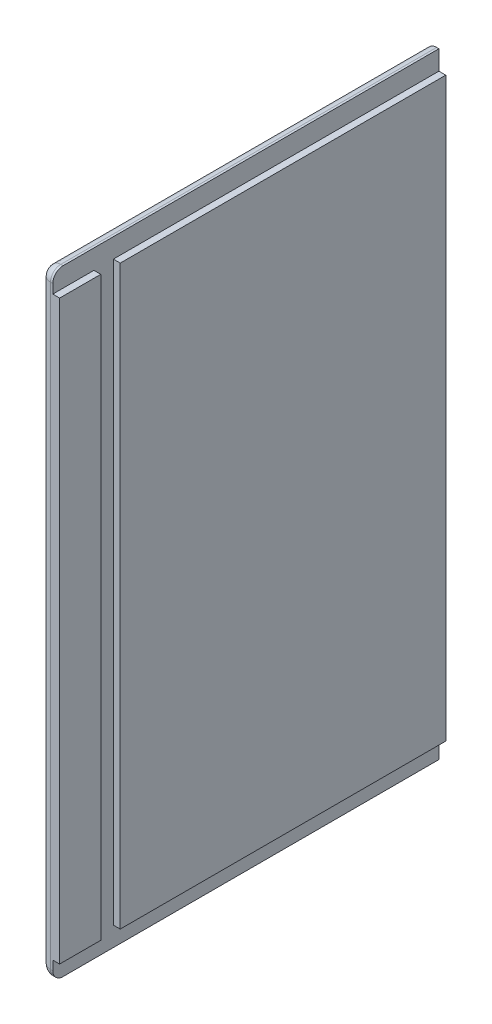
ISO-10303-21;
HEADER;
FILE_DESCRIPTION(('STEP AP214'),'2;1');
FILE_NAME('part.step','',(''),(''),'','','');
FILE_SCHEMA(('AUTOMOTIVE_DESIGN { 1 0 10303 214 1 1 1 1 }'));
ENDSEC;
DATA;
#1=APPLICATION_CONTEXT('core data for automotive mechanical design processes');
#2=APPLICATION_PROTOCOL_DEFINITION('international standard','automotive_design',2000,#1);
#3=PRODUCT_CONTEXT('',#1,'mechanical');
#4=PRODUCT('Part','Part','',(#3));
#5=PRODUCT_RELATED_PRODUCT_CATEGORY('part','',(#4));
#6=PRODUCT_DEFINITION_FORMATION('','',#4);
#7=PRODUCT_DEFINITION_CONTEXT('part definition',#1,'design');
#8=PRODUCT_DEFINITION('design','',#6,#7);
#9=PRODUCT_DEFINITION_SHAPE('','',#8);
#10=(LENGTH_UNIT() NAMED_UNIT(*) SI_UNIT(.MILLI.,.METRE.));
#11=(NAMED_UNIT(*) PLANE_ANGLE_UNIT() SI_UNIT($,.RADIAN.));
#12=(NAMED_UNIT(*) SI_UNIT($,.STERADIAN.) SOLID_ANGLE_UNIT());
#13=UNCERTAINTY_MEASURE_WITH_UNIT(LENGTH_MEASURE(1.E-05),#10,'distance_accuracy_value','');
#14=(GEOMETRIC_REPRESENTATION_CONTEXT(3) GLOBAL_UNCERTAINTY_ASSIGNED_CONTEXT((#13)) GLOBAL_UNIT_ASSIGNED_CONTEXT((#10,
#11,#12)) REPRESENTATION_CONTEXT('',''));
#15=CARTESIAN_POINT('',(0.,0.,0.));
#16=DIRECTION('',(0.,0.,1.));
#17=DIRECTION('',(1.,0.,0.));
#18=AXIS2_PLACEMENT_3D('',#15,#16,#17);
#19=CARTESIAN_POINT('',(18.,570.,0.));
#20=DIRECTION('',(0.,-1.,0.));
#21=DIRECTION('',(0.,0.,-1.));
#22=AXIS2_PLACEMENT_3D('',#19,#20,#21);
#23=PLANE('',#22);
#24=DIRECTION('',(0.,0.,1.));
#25=VECTOR('',#24,1.);
#26=CARTESIAN_POINT('',(9.525,570.,0.));
#27=LINE('',#26,#25);
#28=CARTESIAN_POINT('',(9.525,570.,-357.50000001));
#29=VERTEX_POINT('',#28);
#30=CARTESIAN_POINT('',(9.525,570.,-9.525));
#31=VERTEX_POINT('',#30);
#32=EDGE_CURVE('E243',#29,#31,#27,.T.);
#33=ORIENTED_EDGE('',*,*,#32,.T.);
#34=DIRECTION('',(-1.,0.,0.));
#35=VECTOR('',#34,1.);
#36=CARTESIAN_POINT('',(18.,570.,-9.525));
#37=LINE('',#36,#35);
#38=CARTESIAN_POINT('',(11.65,570.,-9.525));
#39=VERTEX_POINT('',#38);
#40=EDGE_CURVE('E245',#31,#39,#37,.F.);
#41=ORIENTED_EDGE('',*,*,#40,.T.);
#42=DIRECTION('',(0.,0.,1.));
#43=VECTOR('',#42,1.);
#44=CARTESIAN_POINT('',(11.65,570.,0.));
#45=LINE('',#44,#43);
#46=CARTESIAN_POINT('',(11.65,570.,-357.50000001));
#47=VERTEX_POINT('',#46);
#48=EDGE_CURVE('E172',#47,#39,#45,.T.);
#49=ORIENTED_EDGE('',*,*,#48,.F.);
#50=DIRECTION('',(-1.,0.,0.));
#51=VECTOR('',#50,1.);
#52=CARTESIAN_POINT('',(18.,570.,-357.50000001));
#53=LINE('',#52,#51);
#54=EDGE_CURVE('E221',#47,#29,#53,.T.);
#55=ORIENTED_EDGE('',*,*,#54,.T.);
#56=EDGE_LOOP('',(#33,#41,#49,#55));
#57=FACE_BOUND('',#56,.T.);
#58=ADVANCED_FACE('F33',(#57),#23,.F.);
#59=CARTESIAN_POINT('',(18.,0.,0.));
#60=DIRECTION('',(-1.,0.,0.));
#61=DIRECTION('',(0.,0.,1.));
#62=AXIS2_PLACEMENT_3D('',#59,#60,#61);
#63=PLANE('',#62);
#64=DIRECTION('',(0.,1.,0.));
#65=VECTOR('',#64,1.);
#66=CARTESIAN_POINT('',(18.,0.,-357.50000001));
#67=LINE('',#66,#65);
#68=CARTESIAN_POINT('',(18.,18.,-357.50000001));
#69=VERTEX_POINT('',#68);
#70=CARTESIAN_POINT('',(18.,552.,-357.50000001));
#71=VERTEX_POINT('',#70);
#72=EDGE_CURVE('E218',#69,#71,#67,.T.);
#73=ORIENTED_EDGE('',*,*,#72,.T.);
#74=DIRECTION('',(0.,0.,-1.));
#75=VECTOR('',#74,1.);
#76=CARTESIAN_POINT('',(18.,552.,0.));
#77=LINE('',#76,#75);
#78=CARTESIAN_POINT('',(18.,552.,-56.1));
#79=VERTEX_POINT('',#78);
#80=EDGE_CURVE('E270',#79,#71,#77,.T.);
#81=ORIENTED_EDGE('',*,*,#80,.F.);
#82=DIRECTION('',(0.,1.,0.));
#83=VECTOR('',#82,1.);
#84=CARTESIAN_POINT('',(18.,563.65,-56.1));
#85=LINE('',#84,#83);
#86=CARTESIAN_POINT('',(18.,18.,-56.1000000000001));
#87=VERTEX_POINT('',#86);
#88=EDGE_CURVE('E206',#87,#79,#85,.T.);
#89=ORIENTED_EDGE('',*,*,#88,.F.);
#90=DIRECTION('',(0.,0.,1.));
#91=VECTOR('',#90,1.);
#92=CARTESIAN_POINT('',(18.,18.,0.));
#93=LINE('',#92,#91);
#94=EDGE_CURVE('E187',#69,#87,#93,.T.);
#95=ORIENTED_EDGE('',*,*,#94,.F.);
#96=EDGE_LOOP('',(#73,#81,#89,#95));
#97=FACE_BOUND('',#96,.T.);
#98=ADVANCED_FACE('F319',(#97),#63,.F.);
#99=CARTESIAN_POINT('',(18.,0.,0.));
#100=DIRECTION('',(0.,0.,-1.));
#101=DIRECTION('',(-1.,0.,0.));
#102=AXIS2_PLACEMENT_3D('',#99,#100,#101);
#103=PLANE('',#102);
#104=DIRECTION('',(0.,-1.,0.));
#105=VECTOR('',#104,1.);
#106=CARTESIAN_POINT('',(9.525,0.,0.));
#107=LINE('',#106,#105);
#108=CARTESIAN_POINT('',(9.525,560.475,0.));
#109=VERTEX_POINT('',#108);
#110=CARTESIAN_POINT('',(9.525,9.525,0.));
#111=VERTEX_POINT('',#110);
#112=EDGE_CURVE('E234',#109,#111,#107,.T.);
#113=ORIENTED_EDGE('',*,*,#112,.T.);
#114=DIRECTION('',(-1.,0.,0.));
#115=VECTOR('',#114,1.);
#116=CARTESIAN_POINT('',(18.,9.525,0.));
#117=LINE('',#116,#115);
#118=CARTESIAN_POINT('',(11.65,9.525,0.));
#119=VERTEX_POINT('',#118);
#120=EDGE_CURVE('E238',#111,#119,#117,.F.);
#121=ORIENTED_EDGE('',*,*,#120,.T.);
#122=DIRECTION('',(0.,-1.,0.));
#123=VECTOR('',#122,1.);
#124=CARTESIAN_POINT('',(11.65,0.,0.));
#125=LINE('',#124,#123);
#126=CARTESIAN_POINT('',(11.65,18.,0.));
#127=VERTEX_POINT('',#126);
#128=EDGE_CURVE('E184',#127,#119,#125,.T.);
#129=ORIENTED_EDGE('',*,*,#128,.F.);
#130=DIRECTION('',(1.,0.,0.));
#131=VECTOR('',#130,1.);
#132=CARTESIAN_POINT('',(11.65,18.,0.));
#133=LINE('',#132,#131);
#134=CARTESIAN_POINT('',(18.,18.,0.));
#135=VERTEX_POINT('',#134);
#136=EDGE_CURVE('E197',#127,#135,#133,.T.);
#137=ORIENTED_EDGE('',*,*,#136,.T.);
#138=DIRECTION('',(0.,-1.,0.));
#139=VECTOR('',#138,1.);
#140=CARTESIAN_POINT('',(18.,0.,0.));
#141=LINE('',#140,#139);
#142=CARTESIAN_POINT('',(18.,552.,0.));
#143=VERTEX_POINT('',#142);
#144=EDGE_CURVE('E170',#143,#135,#141,.T.);
#145=ORIENTED_EDGE('',*,*,#144,.F.);
#146=DIRECTION('',(1.,0.,0.));
#147=VECTOR('',#146,1.);
#148=CARTESIAN_POINT('',(11.65,552.,0.));
#149=LINE('',#148,#147);
#150=CARTESIAN_POINT('',(11.65,552.,0.));
#151=VERTEX_POINT('',#150);
#152=EDGE_CURVE('E161',#151,#143,#149,.T.);
#153=ORIENTED_EDGE('',*,*,#152,.F.);
#154=DIRECTION('',(0.,-1.,0.));
#155=VECTOR('',#154,1.);
#156=CARTESIAN_POINT('',(11.65,570.,0.));
#157=LINE('',#156,#155);
#158=CARTESIAN_POINT('',(11.65,560.475,0.));
#159=VERTEX_POINT('',#158);
#160=EDGE_CURVE('E144',#159,#151,#157,.T.);
#161=ORIENTED_EDGE('',*,*,#160,.F.);
#162=DIRECTION('',(-1.,0.,0.));
#163=VECTOR('',#162,1.);
#164=CARTESIAN_POINT('',(18.,560.475,0.));
#165=LINE('',#164,#163);
#166=EDGE_CURVE('E236',#159,#109,#165,.T.);
#167=ORIENTED_EDGE('',*,*,#166,.T.);
#168=EDGE_LOOP('',(#113,#121,#129,#137,#145,#153,#161,#167));
#169=FACE_BOUND('',#168,.T.);
#170=ADVANCED_FACE('F168',(#169),#103,.F.);
#171=CARTESIAN_POINT('',(18.,0.,0.));
#172=DIRECTION('',(0.,1.,0.));
#173=DIRECTION('',(0.,0.,1.));
#174=AXIS2_PLACEMENT_3D('',#171,#172,#173);
#175=PLANE('',#174);
#176=DIRECTION('',(0.,0.,-1.));
#177=VECTOR('',#176,1.);
#178=CARTESIAN_POINT('',(11.65,0.,0.));
#179=LINE('',#178,#177);
#180=CARTESIAN_POINT('',(11.65,0.,-9.525));
#181=VERTEX_POINT('',#180);
#182=CARTESIAN_POINT('',(11.65,0.,-357.50000001));
#183=VERTEX_POINT('',#182);
#184=EDGE_CURVE('E186',#181,#183,#179,.T.);
#185=ORIENTED_EDGE('',*,*,#184,.F.);
#186=DIRECTION('',(-1.,0.,0.));
#187=VECTOR('',#186,1.);
#188=CARTESIAN_POINT('',(18.,0.,-9.525));
#189=LINE('',#188,#187);
#190=CARTESIAN_POINT('',(9.525,0.,-9.525));
#191=VERTEX_POINT('',#190);
#192=EDGE_CURVE('E231',#181,#191,#189,.T.);
#193=ORIENTED_EDGE('',*,*,#192,.T.);
#194=DIRECTION('',(0.,0.,-1.));
#195=VECTOR('',#194,1.);
#196=CARTESIAN_POINT('',(9.525,0.,-357.50000001));
#197=LINE('',#196,#195);
#198=CARTESIAN_POINT('',(9.525,0.,-357.50000001));
#199=VERTEX_POINT('',#198);
#200=EDGE_CURVE('E229',#191,#199,#197,.T.);
#201=ORIENTED_EDGE('',*,*,#200,.T.);
#202=DIRECTION('',(-1.,0.,0.));
#203=VECTOR('',#202,1.);
#204=CARTESIAN_POINT('',(18.,0.,-357.50000001));
#205=LINE('',#204,#203);
#206=EDGE_CURVE('E226',#183,#199,#205,.T.);
#207=ORIENTED_EDGE('',*,*,#206,.F.);
#208=EDGE_LOOP('',(#185,#193,#201,#207));
#209=FACE_BOUND('',#208,.T.);
#210=ADVANCED_FACE('F309',(#209),#175,.F.);
#211=CARTESIAN_POINT('',(18.,0.,-357.50000001));
#212=DIRECTION('',(0.,0.,1.));
#213=DIRECTION('',(1.,0.,0.));
#214=AXIS2_PLACEMENT_3D('',#211,#212,#213);
#215=PLANE('',#214);
#216=ORIENTED_EDGE('',*,*,#206,.T.);
#217=CARTESIAN_POINT('',(9.525,9.525,-357.50000001));
#218=DIRECTION('',(0.,0.,1.));
#219=DIRECTION('',(1.,0.,0.));
#220=AXIS2_PLACEMENT_3D('',#217,#218,#219);
#221=CIRCLE('',#220,9.525);
#222=CARTESIAN_POINT('',(0.,9.525,-357.50000001));
#223=VERTEX_POINT('',#222);
#224=EDGE_CURVE('E249',#199,#223,#221,.F.);
#225=ORIENTED_EDGE('',*,*,#224,.T.);
#226=DIRECTION('',(0.,1.,0.));
#227=VECTOR('',#226,1.);
#228=CARTESIAN_POINT('',(0.,0.,-357.50000001));
#229=LINE('',#228,#227);
#230=CARTESIAN_POINT('',(0.,560.475,-357.50000001));
#231=VERTEX_POINT('',#230);
#232=EDGE_CURVE('E213',#223,#231,#229,.T.);
#233=ORIENTED_EDGE('',*,*,#232,.T.);
#234=CARTESIAN_POINT('',(9.525,560.475,-357.50000001));
#235=DIRECTION('',(0.,0.,1.));
#236=DIRECTION('',(1.,0.,0.));
#237=AXIS2_PLACEMENT_3D('',#234,#235,#236);
#238=CIRCLE('',#237,9.525);
#239=EDGE_CURVE('E247',#231,#29,#238,.F.);
#240=ORIENTED_EDGE('',*,*,#239,.T.);
#241=ORIENTED_EDGE('',*,*,#54,.F.);
#242=DIRECTION('',(0.,1.,0.));
#243=VECTOR('',#242,1.);
#244=CARTESIAN_POINT('',(11.65,570.,-357.50000001));
#245=LINE('',#244,#243);
#246=CARTESIAN_POINT('',(11.65,552.,-357.50000001));
#247=VERTEX_POINT('',#246);
#248=EDGE_CURVE('E165',#247,#47,#245,.T.);
#249=ORIENTED_EDGE('',*,*,#248,.F.);
#250=DIRECTION('',(1.,0.,0.));
#251=VECTOR('',#250,1.);
#252=CARTESIAN_POINT('',(11.65,552.,-357.50000001));
#253=LINE('',#252,#251);
#254=EDGE_CURVE('E171',#247,#71,#253,.T.);
#255=ORIENTED_EDGE('',*,*,#254,.T.);
#256=ORIENTED_EDGE('',*,*,#72,.F.);
#257=DIRECTION('',(1.,0.,0.));
#258=VECTOR('',#257,1.);
#259=CARTESIAN_POINT('',(11.65,18.,-357.50000001));
#260=LINE('',#259,#258);
#261=CARTESIAN_POINT('',(11.65,18.,-357.50000001));
#262=VERTEX_POINT('',#261);
#263=EDGE_CURVE('E195',#262,#69,#260,.T.);
#264=ORIENTED_EDGE('',*,*,#263,.F.);
#265=DIRECTION('',(0.,1.,0.));
#266=VECTOR('',#265,1.);
#267=CARTESIAN_POINT('',(11.65,0.,-357.50000001));
#268=LINE('',#267,#266);
#269=EDGE_CURVE('E189',#183,#262,#268,.T.);
#270=ORIENTED_EDGE('',*,*,#269,.F.);
#271=EDGE_LOOP('',(#216,#225,#233,#240,#241,#249,#255,#256,#264,#270));
#272=FACE_BOUND('',#271,.T.);
#273=ADVANCED_FACE('F283',(#272),#215,.F.);
#274=DIRECTION('',(0.,-1.,0.));
#275=VECTOR('',#274,1.);
#276=CARTESIAN_POINT('',(18.,563.65,-38.1));
#277=LINE('',#276,#275);
#278=CARTESIAN_POINT('',(18.,552.,-38.1));
#279=VERTEX_POINT('',#278);
#280=CARTESIAN_POINT('',(18.,18.,-38.1000000000001));
#281=VERTEX_POINT('',#280);
#282=EDGE_CURVE('E211',#279,#281,#277,.T.);
#283=ORIENTED_EDGE('',*,*,#282,.F.);
#284=EDGE_CURVE('E157',#143,#279,#77,.T.);
#285=ORIENTED_EDGE('',*,*,#284,.F.);
#286=ORIENTED_EDGE('',*,*,#144,.T.);
#287=EDGE_CURVE('E183',#281,#135,#93,.T.);
#288=ORIENTED_EDGE('',*,*,#287,.F.);
#289=EDGE_LOOP('',(#283,#285,#286,#288));
#290=FACE_BOUND('',#289,.T.);
#291=ADVANCED_FACE('F341',(#290),#63,.F.);
#292=CARTESIAN_POINT('',(0.,0.,0.));
#293=DIRECTION('',(-1.,0.,0.));
#294=DIRECTION('',(0.,0.,1.));
#295=AXIS2_PLACEMENT_3D('',#292,#293,#294);
#296=PLANE('',#295);
#297=ORIENTED_EDGE('',*,*,#232,.F.);
#298=DIRECTION('',(0.,0.,-1.));
#299=VECTOR('',#298,1.);
#300=CARTESIAN_POINT('',(0.,9.525,0.));
#301=LINE('',#300,#299);
#302=CARTESIAN_POINT('',(0.,9.525,-9.525));
#303=VERTEX_POINT('',#302);
#304=EDGE_CURVE('E11',#223,#303,#301,.F.);
#305=ORIENTED_EDGE('',*,*,#304,.T.);
#306=DIRECTION('',(0.,-1.,0.));
#307=VECTOR('',#306,1.);
#308=CARTESIAN_POINT('',(0.,570.,-9.525));
#309=LINE('',#308,#307);
#310=CARTESIAN_POINT('',(0.,560.475,-9.525));
#311=VERTEX_POINT('',#310);
#312=EDGE_CURVE('E42',#303,#311,#309,.F.);
#313=ORIENTED_EDGE('',*,*,#312,.T.);
#314=DIRECTION('',(0.,0.,1.));
#315=VECTOR('',#314,1.);
#316=CARTESIAN_POINT('',(0.,560.475,-357.50000001));
#317=LINE('',#316,#315);
#318=EDGE_CURVE('E251',#311,#231,#317,.F.);
#319=ORIENTED_EDGE('',*,*,#318,.T.);
#320=EDGE_LOOP('',(#297,#305,#313,#319));
#321=FACE_BOUND('',#320,.T.);
#322=ADVANCED_FACE('F344',(#321),#296,.T.);
#323=CARTESIAN_POINT('',(11.65,563.65,-56.1));
#324=DIRECTION('',(0.,0.,-1.));
#325=DIRECTION('',(0.,1.,0.));
#326=AXIS2_PLACEMENT_3D('',#323,#324,#325);
#327=PLANE('',#326);
#328=ORIENTED_EDGE('',*,*,#88,.T.);
#329=DIRECTION('',(-1.,0.,0.));
#330=VECTOR('',#329,1.);
#331=CARTESIAN_POINT('',(11.65,552.,-56.1));
#332=LINE('',#331,#330);
#333=CARTESIAN_POINT('',(11.65,552.,-56.1));
#334=VERTEX_POINT('',#333);
#335=EDGE_CURVE('E180',#79,#334,#332,.T.);
#336=ORIENTED_EDGE('',*,*,#335,.T.);
#337=DIRECTION('',(0.,1.,0.));
#338=VECTOR('',#337,1.);
#339=CARTESIAN_POINT('',(11.65,563.65,-56.1));
#340=LINE('',#339,#338);
#341=CARTESIAN_POINT('',(11.65,18.,-56.1000000000001));
#342=VERTEX_POINT('',#341);
#343=EDGE_CURVE('E207',#342,#334,#340,.T.);
#344=ORIENTED_EDGE('',*,*,#343,.F.);
#345=DIRECTION('',(1.,0.,0.));
#346=VECTOR('',#345,1.);
#347=CARTESIAN_POINT('',(11.65,18.,-56.1000000000001));
#348=LINE('',#347,#346);
#349=EDGE_CURVE('E203',#342,#87,#348,.T.);
#350=ORIENTED_EDGE('',*,*,#349,.T.);
#351=EDGE_LOOP('',(#328,#336,#344,#350));
#352=FACE_BOUND('',#351,.T.);
#353=ADVANCED_FACE('F321',(#352),#327,.F.);
#354=CARTESIAN_POINT('',(11.65,563.65,-38.1));
#355=DIRECTION('',(0.,0.,1.));
#356=DIRECTION('',(0.,-1.,0.));
#357=AXIS2_PLACEMENT_3D('',#354,#355,#356);
#358=PLANE('',#357);
#359=DIRECTION('',(0.,-1.,0.));
#360=VECTOR('',#359,1.);
#361=CARTESIAN_POINT('',(11.65,563.65,-38.1));
#362=LINE('',#361,#360);
#363=CARTESIAN_POINT('',(11.65,552.,-38.1));
#364=VERTEX_POINT('',#363);
#365=CARTESIAN_POINT('',(11.65,18.,-38.1));
#366=VERTEX_POINT('',#365);
#367=EDGE_CURVE('E210',#364,#366,#362,.T.);
#368=ORIENTED_EDGE('',*,*,#367,.F.);
#369=DIRECTION('',(1.,0.,0.));
#370=VECTOR('',#369,1.);
#371=CARTESIAN_POINT('',(11.65,552.,-38.1));
#372=LINE('',#371,#370);
#373=EDGE_CURVE('E164',#364,#279,#372,.T.);
#374=ORIENTED_EDGE('',*,*,#373,.T.);
#375=ORIENTED_EDGE('',*,*,#282,.T.);
#376=DIRECTION('',(-1.,0.,0.));
#377=VECTOR('',#376,1.);
#378=CARTESIAN_POINT('',(11.65,18.,-38.1000000000001));
#379=LINE('',#378,#377);
#380=EDGE_CURVE('E199',#281,#366,#379,.T.);
#381=ORIENTED_EDGE('',*,*,#380,.T.);
#382=EDGE_LOOP('',(#368,#374,#375,#381));
#383=FACE_BOUND('',#382,.T.);
#384=ADVANCED_FACE('F394',(#383),#358,.F.);
#385=CARTESIAN_POINT('',(11.65,0.,0.));
#386=DIRECTION('',(-1.,0.,0.));
#387=DIRECTION('',(0.,0.,1.));
#388=AXIS2_PLACEMENT_3D('',#385,#386,#387);
#389=PLANE('',#388);
#390=ORIENTED_EDGE('',*,*,#128,.T.);
#391=CARTESIAN_POINT('',(11.65,9.525,-9.525));
#392=DIRECTION('',(-1.,0.,0.));
#393=DIRECTION('',(0.,0.,1.));
#394=AXIS2_PLACEMENT_3D('',#391,#392,#393);
#395=CIRCLE('',#394,9.525);
#396=EDGE_CURVE('E241',#119,#181,#395,.F.);
#397=ORIENTED_EDGE('',*,*,#396,.T.);
#398=ORIENTED_EDGE('',*,*,#184,.T.);
#399=ORIENTED_EDGE('',*,*,#269,.T.);
#400=DIRECTION('',(0.,0.,1.));
#401=VECTOR('',#400,1.);
#402=CARTESIAN_POINT('',(11.65,18.,0.));
#403=LINE('',#402,#401);
#404=EDGE_CURVE('E192',#262,#342,#403,.T.);
#405=ORIENTED_EDGE('',*,*,#404,.T.);
#406=ORIENTED_EDGE('',*,*,#343,.T.);
#407=DIRECTION('',(0.,0.,-1.));
#408=VECTOR('',#407,1.);
#409=CARTESIAN_POINT('',(11.65,552.,0.));
#410=LINE('',#409,#408);
#411=EDGE_CURVE('E156',#334,#247,#410,.T.);
#412=ORIENTED_EDGE('',*,*,#411,.T.);
#413=ORIENTED_EDGE('',*,*,#248,.T.);
#414=ORIENTED_EDGE('',*,*,#48,.T.);
#415=CARTESIAN_POINT('',(11.65,560.475,-9.525));
#416=DIRECTION('',(-1.,0.,0.));
#417=DIRECTION('',(0.,0.,1.));
#418=AXIS2_PLACEMENT_3D('',#415,#416,#417);
#419=CIRCLE('',#418,9.525);
#420=EDGE_CURVE('E152',#39,#159,#419,.F.);
#421=ORIENTED_EDGE('',*,*,#420,.T.);
#422=ORIENTED_EDGE('',*,*,#160,.T.);
#423=EDGE_CURVE('E148',#151,#364,#410,.T.);
#424=ORIENTED_EDGE('',*,*,#423,.T.);
#425=ORIENTED_EDGE('',*,*,#367,.T.);
#426=EDGE_CURVE('E191',#366,#127,#403,.T.);
#427=ORIENTED_EDGE('',*,*,#426,.T.);
#428=EDGE_LOOP('',(#390,#397,#398,#399,#405,#406,#412,#413,#414,#421,#422,#424,#425,#427));
#429=FACE_BOUND('',#428,.T.);
#430=ADVANCED_FACE('F147',(#429),#389,.F.);
#431=CARTESIAN_POINT('',(11.65,18.,0.));
#432=DIRECTION('',(0.,1.,0.));
#433=DIRECTION('',(0.,0.,1.));
#434=AXIS2_PLACEMENT_3D('',#431,#432,#433);
#435=PLANE('',#434);
#436=ORIENTED_EDGE('',*,*,#404,.F.);
#437=ORIENTED_EDGE('',*,*,#263,.T.);
#438=ORIENTED_EDGE('',*,*,#94,.T.);
#439=ORIENTED_EDGE('',*,*,#349,.F.);
#440=EDGE_LOOP('',(#436,#437,#438,#439));
#441=FACE_BOUND('',#440,.T.);
#442=ADVANCED_FACE('F316',(#441),#435,.F.);
#443=ORIENTED_EDGE('',*,*,#287,.T.);
#444=ORIENTED_EDGE('',*,*,#136,.F.);
#445=ORIENTED_EDGE('',*,*,#426,.F.);
#446=ORIENTED_EDGE('',*,*,#380,.F.);
#447=EDGE_LOOP('',(#443,#444,#445,#446));
#448=FACE_BOUND('',#447,.T.);
#449=ADVANCED_FACE('F325',(#448),#435,.F.);
#450=CARTESIAN_POINT('',(11.65,552.,0.));
#451=DIRECTION('',(0.,-1.,0.));
#452=DIRECTION('',(0.,0.,-1.));
#453=AXIS2_PLACEMENT_3D('',#450,#451,#452);
#454=PLANE('',#453);
#455=ORIENTED_EDGE('',*,*,#80,.T.);
#456=ORIENTED_EDGE('',*,*,#254,.F.);
#457=ORIENTED_EDGE('',*,*,#411,.F.);
#458=ORIENTED_EDGE('',*,*,#335,.F.);
#459=EDGE_LOOP('',(#455,#456,#457,#458));
#460=FACE_BOUND('',#459,.T.);
#461=ADVANCED_FACE('F323',(#460),#454,.F.);
#462=ORIENTED_EDGE('',*,*,#423,.F.);
#463=ORIENTED_EDGE('',*,*,#152,.T.);
#464=ORIENTED_EDGE('',*,*,#284,.T.);
#465=ORIENTED_EDGE('',*,*,#373,.F.);
#466=EDGE_LOOP('',(#462,#463,#464,#465));
#467=FACE_BOUND('',#466,.T.);
#468=ADVANCED_FACE('F160',(#467),#454,.F.);
#469=CARTESIAN_POINT('',(9.525,560.475,0.));
#470=DIRECTION('',(0.,0.,-1.));
#471=DIRECTION('',(-1.,0.,0.));
#472=AXIS2_PLACEMENT_3D('',#469,#470,#471);
#473=CYLINDRICAL_SURFACE('',#472,9.525);
#474=ORIENTED_EDGE('',*,*,#239,.F.);
#475=ORIENTED_EDGE('',*,*,#318,.F.);
#476=CARTESIAN_POINT('',(9.525,560.475,-9.525));
#477=DIRECTION('',(0.,0.,1.));
#478=DIRECTION('',(1.,0.,0.));
#479=AXIS2_PLACEMENT_3D('',#476,#477,#478);
#480=CIRCLE('',#479,9.525);
#481=EDGE_CURVE('E37',#31,#311,#480,.T.);
#482=ORIENTED_EDGE('',*,*,#481,.F.);
#483=ORIENTED_EDGE('',*,*,#32,.F.);
#484=EDGE_LOOP('',(#474,#475,#482,#483));
#485=FACE_BOUND('',#484,.T.);
#486=ADVANCED_FACE('F35',(#485),#473,.T.);
#487=CARTESIAN_POINT('',(18.,560.475,-9.525));
#488=DIRECTION('',(-1.,0.,0.));
#489=DIRECTION('',(0.,0.,1.));
#490=AXIS2_PLACEMENT_3D('',#487,#488,#489);
#491=CYLINDRICAL_SURFACE('',#490,9.525);
#492=ORIENTED_EDGE('',*,*,#420,.F.);
#493=ORIENTED_EDGE('',*,*,#40,.F.);
#494=CARTESIAN_POINT('',(9.525,560.475,-9.525));
#495=DIRECTION('',(-1.,0.,0.));
#496=DIRECTION('',(0.,0.,1.));
#497=AXIS2_PLACEMENT_3D('',#494,#495,#496);
#498=CIRCLE('',#497,9.525);
#499=EDGE_CURVE('E264',#109,#31,#498,.T.);
#500=ORIENTED_EDGE('',*,*,#499,.F.);
#501=ORIENTED_EDGE('',*,*,#166,.F.);
#502=EDGE_LOOP('',(#492,#493,#500,#501));
#503=FACE_BOUND('',#502,.T.);
#504=ADVANCED_FACE('F287',(#503),#491,.T.);
#505=CARTESIAN_POINT('',(9.525,560.475,-9.525));
#506=DIRECTION('',(0.,0.,1.));
#507=DIRECTION('',(1.,0.,0.));
#508=AXIS2_PLACEMENT_3D('',#505,#506,#507);
#509=SPHERICAL_SURFACE('',#508,9.525);
#510=ORIENTED_EDGE('',*,*,#499,.T.);
#511=ORIENTED_EDGE('',*,*,#481,.T.);
#512=CARTESIAN_POINT('',(9.525,560.475,-9.525));
#513=DIRECTION('',(0.,1.,0.));
#514=DIRECTION('',(0.,0.,1.));
#515=AXIS2_PLACEMENT_3D('',#512,#513,#514);
#516=CIRCLE('',#515,9.525);
#517=EDGE_CURVE('E262',#109,#311,#516,.F.);
#518=ORIENTED_EDGE('',*,*,#517,.F.);
#519=EDGE_LOOP('',(#510,#511,#518));
#520=FACE_BOUND('',#519,.T.);
#521=ADVANCED_FACE('F358',(#520),#509,.T.);
#522=CARTESIAN_POINT('',(9.525,9.525,0.));
#523=DIRECTION('',(0.,0.,1.));
#524=DIRECTION('',(1.,0.,0.));
#525=AXIS2_PLACEMENT_3D('',#522,#523,#524);
#526=CYLINDRICAL_SURFACE('',#525,9.525);
#527=ORIENTED_EDGE('',*,*,#224,.F.);
#528=ORIENTED_EDGE('',*,*,#200,.F.);
#529=CARTESIAN_POINT('',(9.525,9.525,-9.525));
#530=DIRECTION('',(0.,0.,1.));
#531=DIRECTION('',(1.,0.,0.));
#532=AXIS2_PLACEMENT_3D('',#529,#530,#531);
#533=CIRCLE('',#532,9.525);
#534=EDGE_CURVE('E259',#303,#191,#533,.T.);
#535=ORIENTED_EDGE('',*,*,#534,.F.);
#536=ORIENTED_EDGE('',*,*,#304,.F.);
#537=EDGE_LOOP('',(#527,#528,#535,#536));
#538=FACE_BOUND('',#537,.T.);
#539=ADVANCED_FACE('F305',(#538),#526,.T.);
#540=CARTESIAN_POINT('',(9.525,0.,-9.525));
#541=DIRECTION('',(0.,1.,0.));
#542=DIRECTION('',(0.,0.,1.));
#543=AXIS2_PLACEMENT_3D('',#540,#541,#542);
#544=CYLINDRICAL_SURFACE('',#543,9.525);
#545=ORIENTED_EDGE('',*,*,#517,.T.);
#546=ORIENTED_EDGE('',*,*,#312,.F.);
#547=CARTESIAN_POINT('',(9.525,9.525,-9.525));
#548=DIRECTION('',(0.,-1.,0.));
#549=DIRECTION('',(0.,0.,-1.));
#550=AXIS2_PLACEMENT_3D('',#547,#548,#549);
#551=CIRCLE('',#550,9.525);
#552=EDGE_CURVE('E256',#111,#303,#551,.T.);
#553=ORIENTED_EDGE('',*,*,#552,.F.);
#554=ORIENTED_EDGE('',*,*,#112,.F.);
#555=EDGE_LOOP('',(#545,#546,#553,#554));
#556=FACE_BOUND('',#555,.T.);
#557=ADVANCED_FACE('F293',(#556),#544,.T.);
#558=CARTESIAN_POINT('',(9.525,9.525,-9.525));
#559=DIRECTION('',(0.,0.,1.));
#560=DIRECTION('',(1.,0.,0.));
#561=AXIS2_PLACEMENT_3D('',#558,#559,#560);
#562=SPHERICAL_SURFACE('',#561,9.525);
#563=ORIENTED_EDGE('',*,*,#552,.T.);
#564=ORIENTED_EDGE('',*,*,#534,.T.);
#565=CARTESIAN_POINT('',(9.525,9.525,-9.525));
#566=DIRECTION('',(-1.,0.,0.));
#567=DIRECTION('',(0.,0.,1.));
#568=AXIS2_PLACEMENT_3D('',#565,#566,#567);
#569=CIRCLE('',#568,9.525);
#570=EDGE_CURVE('E254',#111,#191,#569,.F.);
#571=ORIENTED_EDGE('',*,*,#570,.F.);
#572=EDGE_LOOP('',(#563,#564,#571));
#573=FACE_BOUND('',#572,.T.);
#574=ADVANCED_FACE('F301',(#573),#562,.T.);
#575=CARTESIAN_POINT('',(18.,9.525,-9.525));
#576=DIRECTION('',(-1.,0.,0.));
#577=DIRECTION('',(0.,0.,1.));
#578=AXIS2_PLACEMENT_3D('',#575,#576,#577);
#579=CYLINDRICAL_SURFACE('',#578,9.525);
#580=ORIENTED_EDGE('',*,*,#396,.F.);
#581=ORIENTED_EDGE('',*,*,#120,.F.);
#582=ORIENTED_EDGE('',*,*,#570,.T.);
#583=ORIENTED_EDGE('',*,*,#192,.F.);
#584=EDGE_LOOP('',(#580,#581,#582,#583));
#585=FACE_BOUND('',#584,.T.);
#586=ADVANCED_FACE('F299',(#585),#579,.T.);
#587=CLOSED_SHELL('',(#58,#98,#170,#210,#273,#291,#322,#353,#384,#430,#442,#449,#461,#468,#486,
#504,#521,#539,#557,#574,#586));
#588=MANIFOLD_SOLID_BREP('B2',#587);
#589=ADVANCED_BREP_SHAPE_REPRESENTATION('',(#18,#588),#14);
#590=SHAPE_DEFINITION_REPRESENTATION(#9,#589);
ENDSEC;
END-ISO-10303-21;
